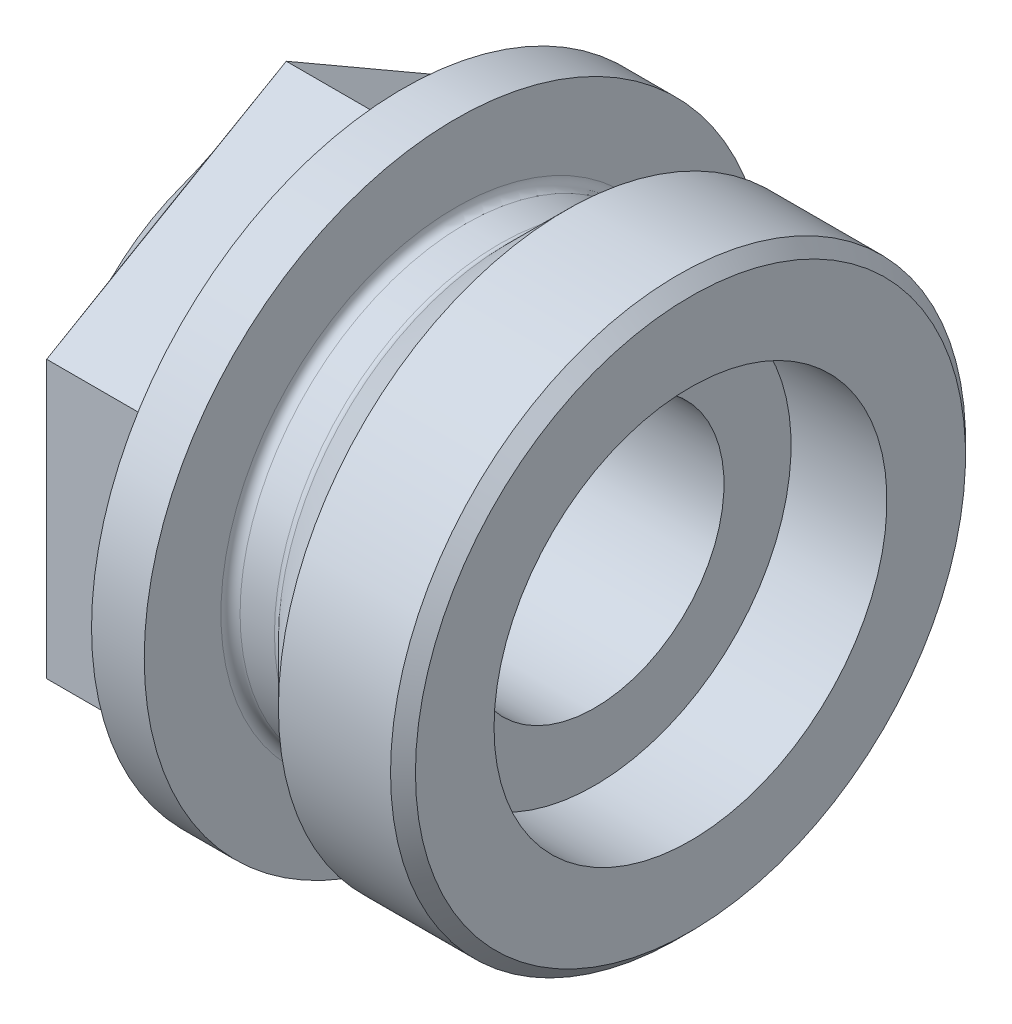
ISO-10303-21;
HEADER;
FILE_DESCRIPTION(('STEP AP214'),'2;1');
FILE_NAME('part.step','',(''),(''),'','','');
FILE_SCHEMA(('AUTOMOTIVE_DESIGN { 1 0 10303 214 1 1 1 1 }'));
ENDSEC;
DATA;
#1=APPLICATION_CONTEXT('core data for automotive mechanical design processes');
#2=APPLICATION_PROTOCOL_DEFINITION('international standard','automotive_design',2000,#1);
#3=PRODUCT_CONTEXT('',#1,'mechanical');
#4=PRODUCT('Part','Part','',(#3));
#5=PRODUCT_RELATED_PRODUCT_CATEGORY('part','',(#4));
#6=PRODUCT_DEFINITION_FORMATION('','',#4);
#7=PRODUCT_DEFINITION_CONTEXT('part definition',#1,'design');
#8=PRODUCT_DEFINITION('design','',#6,#7);
#9=PRODUCT_DEFINITION_SHAPE('','',#8);
#10=(LENGTH_UNIT() NAMED_UNIT(*) SI_UNIT(.MILLI.,.METRE.));
#11=(NAMED_UNIT(*) PLANE_ANGLE_UNIT() SI_UNIT($,.RADIAN.));
#12=(NAMED_UNIT(*) SI_UNIT($,.STERADIAN.) SOLID_ANGLE_UNIT());
#13=UNCERTAINTY_MEASURE_WITH_UNIT(LENGTH_MEASURE(1.E-05),#10,'distance_accuracy_value','');
#14=(GEOMETRIC_REPRESENTATION_CONTEXT(3) GLOBAL_UNCERTAINTY_ASSIGNED_CONTEXT((#13)) GLOBAL_UNIT_ASSIGNED_CONTEXT((#10,
#11,#12)) REPRESENTATION_CONTEXT('',''));
#15=CARTESIAN_POINT('',(0.,0.,0.));
#16=DIRECTION('',(0.,0.,1.));
#17=DIRECTION('',(1.,0.,0.));
#18=AXIS2_PLACEMENT_3D('',#15,#16,#17);
#19=CARTESIAN_POINT('',(0.,0.,0.));
#20=DIRECTION('',(-1.,0.,0.));
#21=DIRECTION('',(0.,0.,1.));
#22=AXIS2_PLACEMENT_3D('',#19,#20,#21);
#23=CYLINDRICAL_SURFACE('',#22,20.5);
#24=CARTESIAN_POINT('',(9.5,0.,0.));
#25=DIRECTION('',(-1.,0.,0.));
#26=DIRECTION('',(0.,0.,1.));
#27=AXIS2_PLACEMENT_3D('',#24,#25,#26);
#28=CIRCLE('',#27,20.5);
#29=CARTESIAN_POINT('',(9.5,0.,20.5));
#30=VERTEX_POINT('',#29);
#31=EDGE_CURVE('E169',#30,#30,#28,.T.);
#32=ORIENTED_EDGE('',*,*,#31,.T.);
#33=EDGE_LOOP('',(#32));
#34=FACE_BOUND('',#33,.T.);
#35=CARTESIAN_POINT('',(19.5,0.,0.));
#36=DIRECTION('',(-1.,0.,0.));
#37=DIRECTION('',(0.,0.,1.));
#38=AXIS2_PLACEMENT_3D('',#35,#36,#37);
#39=CIRCLE('',#38,20.5);
#40=CARTESIAN_POINT('',(19.5,0.,20.5));
#41=VERTEX_POINT('',#40);
#42=EDGE_CURVE('E185',#41,#41,#39,.T.);
#43=ORIENTED_EDGE('',*,*,#42,.F.);
#44=EDGE_LOOP('',(#43));
#45=FACE_BOUND('',#44,.T.);
#46=ADVANCED_FACE('F81',(#34,#45),#23,.F.);
#47=CARTESIAN_POINT('',(19.5,-20.5,0.));
#48=DIRECTION('',(1.,0.,0.));
#49=DIRECTION('',(0.,0.,-1.));
#50=AXIS2_PLACEMENT_3D('',#47,#48,#49);
#51=PLANE('',#50);
#52=CARTESIAN_POINT('',(19.5,0.,0.));
#53=DIRECTION('',(1.,0.,0.));
#54=DIRECTION('',(0.,0.,-1.));
#55=AXIS2_PLACEMENT_3D('',#52,#53,#54);
#56=CIRCLE('',#55,28.7);
#57=CARTESIAN_POINT('',(19.5,0.,28.7));
#58=VERTEX_POINT('',#57);
#59=EDGE_CURVE('E13',#58,#58,#56,.T.);
#60=ORIENTED_EDGE('',*,*,#59,.T.);
#61=EDGE_LOOP('',(#60));
#62=FACE_BOUND('',#61,.T.);
#63=ORIENTED_EDGE('',*,*,#42,.T.);
#64=EDGE_LOOP('',(#63));
#65=FACE_BOUND('',#64,.T.);
#66=ADVANCED_FACE('F241',(#62,#65),#51,.T.);
#67=CARTESIAN_POINT('',(0.,0.,0.));
#68=DIRECTION('',(-1.,0.,0.));
#69=DIRECTION('',(0.,0.,1.));
#70=AXIS2_PLACEMENT_3D('',#67,#68,#69);
#71=CYLINDRICAL_SURFACE('',#70,30.);
#72=CARTESIAN_POINT('',(18.2,0.,0.));
#73=DIRECTION('',(1.,0.,0.));
#74=DIRECTION('',(0.,0.,-1.));
#75=AXIS2_PLACEMENT_3D('',#72,#73,#74);
#76=CIRCLE('',#75,30.);
#77=CARTESIAN_POINT('',(18.2,0.,30.));
#78=VERTEX_POINT('',#77);
#79=EDGE_CURVE('E91',#78,#78,#76,.F.);
#80=ORIENTED_EDGE('',*,*,#79,.T.);
#81=EDGE_LOOP('',(#80));
#82=FACE_BOUND('',#81,.T.);
#83=CARTESIAN_POINT('',(6.49999999999989,0.,0.));
#84=DIRECTION('',(-1.,0.,0.));
#85=DIRECTION('',(0.,0.,1.));
#86=AXIS2_PLACEMENT_3D('',#83,#84,#85);
#87=CIRCLE('',#86,30.);
#88=CARTESIAN_POINT('',(6.49999999999989,0.,30.));
#89=VERTEX_POINT('',#88);
#90=EDGE_CURVE('E182',#89,#89,#87,.T.);
#91=ORIENTED_EDGE('',*,*,#90,.F.);
#92=EDGE_LOOP('',(#91));
#93=FACE_BOUND('',#92,.T.);
#94=ADVANCED_FACE('F228',(#82,#93),#71,.T.);
#95=CARTESIAN_POINT('',(0.,0.,0.));
#96=DIRECTION('',(1.,0.,0.));
#97=DIRECTION('',(0.,0.,-1.));
#98=AXIS2_PLACEMENT_3D('',#95,#96,#97);
#99=CONICAL_SURFACE('',#98,23.5,0.785398163397457);
#100=CARTESIAN_POINT('',(0.292893218813452,0.,0.));
#101=DIRECTION('',(1.,0.,0.));
#102=DIRECTION('',(0.,0.,-1.));
#103=AXIS2_PLACEMENT_3D('',#100,#101,#102);
#104=CIRCLE('',#103,23.7928932188135);
#105=CARTESIAN_POINT('',(0.292893218813452,0.,-23.7928932188135));
#106=VERTEX_POINT('',#105);
#107=EDGE_CURVE('E220',#106,#106,#104,.T.);
#108=ORIENTED_EDGE('',*,*,#107,.T.);
#109=EDGE_LOOP('',(#108));
#110=FACE_BOUND('',#109,.T.);
#111=ORIENTED_EDGE('',*,*,#90,.T.);
#112=EDGE_LOOP('',(#111));
#113=FACE_BOUND('',#112,.T.);
#114=ADVANCED_FACE('F269',(#110,#113),#99,.T.);
#115=CARTESIAN_POINT('',(0.,0.,0.));
#116=DIRECTION('',(-1.,0.,0.));
#117=DIRECTION('',(0.,0.,1.));
#118=AXIS2_PLACEMENT_3D('',#115,#116,#117);
#119=CYLINDRICAL_SURFACE('',#118,23.5);
#120=CARTESIAN_POINT('',(-0.414213562373099,0.,0.));
#121=DIRECTION('',(-1.,0.,0.));
#122=DIRECTION('',(0.,0.,1.));
#123=AXIS2_PLACEMENT_3D('',#120,#121,#122);
#124=CIRCLE('',#123,23.5);
#125=CARTESIAN_POINT('',(-0.414213562373099,0.,23.5));
#126=VERTEX_POINT('',#125);
#127=EDGE_CURVE('E217',#126,#126,#124,.T.);
#128=ORIENTED_EDGE('',*,*,#127,.T.);
#129=EDGE_LOOP('',(#128));
#130=FACE_BOUND('',#129,.T.);
#131=CARTESIAN_POINT('',(-4.,0.,0.));
#132=DIRECTION('',(1.,0.,0.));
#133=DIRECTION('',(0.,0.,-1.));
#134=AXIS2_PLACEMENT_3D('',#131,#132,#133);
#135=CIRCLE('',#134,23.5);
#136=CARTESIAN_POINT('',(-4.,0.,-23.5));
#137=VERTEX_POINT('',#136);
#138=EDGE_CURVE('E188',#137,#137,#135,.T.);
#139=ORIENTED_EDGE('',*,*,#138,.T.);
#140=EDGE_LOOP('',(#139));
#141=FACE_BOUND('',#140,.T.);
#142=ADVANCED_FACE('F265',(#130,#141),#119,.T.);
#143=CARTESIAN_POINT('',(-5.,-23.5,0.));
#144=DIRECTION('',(1.,0.,0.));
#145=DIRECTION('',(0.,0.,-1.));
#146=AXIS2_PLACEMENT_3D('',#143,#144,#145);
#147=PLANE('',#146);
#148=CARTESIAN_POINT('',(-5.,0.,0.));
#149=DIRECTION('',(1.,0.,0.));
#150=DIRECTION('',(0.,0.,-1.));
#151=AXIS2_PLACEMENT_3D('',#148,#149,#150);
#152=CIRCLE('',#151,24.5);
#153=CARTESIAN_POINT('',(-5.,0.,-24.5));
#154=VERTEX_POINT('',#153);
#155=EDGE_CURVE('E223',#154,#154,#152,.F.);
#156=ORIENTED_EDGE('',*,*,#155,.T.);
#157=EDGE_LOOP('',(#156));
#158=FACE_BOUND('',#157,.T.);
#159=CARTESIAN_POINT('',(-5.,0.,0.));
#160=DIRECTION('',(-1.,0.,0.));
#161=DIRECTION('',(0.,0.,1.));
#162=AXIS2_PLACEMENT_3D('',#159,#160,#161);
#163=CIRCLE('',#162,32.5);
#164=CARTESIAN_POINT('',(-5.,0.,32.5));
#165=VERTEX_POINT('',#164);
#166=EDGE_CURVE('E179',#165,#165,#163,.T.);
#167=ORIENTED_EDGE('',*,*,#166,.F.);
#168=EDGE_LOOP('',(#167));
#169=FACE_BOUND('',#168,.T.);
#170=ADVANCED_FACE('F268',(#158,#169),#147,.T.);
#171=CARTESIAN_POINT('',(0.,0.,0.));
#172=DIRECTION('',(-1.,0.,0.));
#173=DIRECTION('',(0.,0.,1.));
#174=AXIS2_PLACEMENT_3D('',#171,#172,#173);
#175=CYLINDRICAL_SURFACE('',#174,32.5);
#176=ORIENTED_EDGE('',*,*,#166,.T.);
#177=EDGE_LOOP('',(#176));
#178=FACE_BOUND('',#177,.T.);
#179=CARTESIAN_POINT('',(-10.5,0.,0.));
#180=DIRECTION('',(-1.,0.,0.));
#181=DIRECTION('',(0.,0.,1.));
#182=AXIS2_PLACEMENT_3D('',#179,#180,#181);
#183=CIRCLE('',#182,32.5);
#184=CARTESIAN_POINT('',(-10.5,0.,32.5));
#185=VERTEX_POINT('',#184);
#186=EDGE_CURVE('E176',#185,#185,#183,.T.);
#187=ORIENTED_EDGE('',*,*,#186,.F.);
#188=EDGE_LOOP('',(#187));
#189=FACE_BOUND('',#188,.T.);
#190=ADVANCED_FACE('F277',(#178,#189),#175,.T.);
#191=CARTESIAN_POINT('',(-10.5,-32.5,0.));
#192=DIRECTION('',(-1.,0.,0.));
#193=DIRECTION('',(0.,0.,1.));
#194=AXIS2_PLACEMENT_3D('',#191,#192,#193);
#195=PLANE('',#194);
#196=DIRECTION('',(0.,1.,0.));
#197=VECTOR('',#196,1.);
#198=CARTESIAN_POINT('',(-10.5,-14.4337567297407,25.));
#199=LINE('',#198,#197);
#200=CARTESIAN_POINT('',(-10.5,-14.4337567297407,25.));
#201=VERTEX_POINT('',#200);
#202=CARTESIAN_POINT('',(-10.5,14.4337567297407,25.));
#203=VERTEX_POINT('',#202);
#204=EDGE_CURVE('E99',#201,#203,#199,.T.);
#205=ORIENTED_EDGE('',*,*,#204,.F.);
#206=DIRECTION('',(0.,0.5,0.866025403784439));
#207=VECTOR('',#206,1.);
#208=CARTESIAN_POINT('',(-10.5,-28.8675134594813,0.));
#209=LINE('',#208,#207);
#210=CARTESIAN_POINT('',(-10.5,-28.8675134594813,0.));
#211=VERTEX_POINT('',#210);
#212=EDGE_CURVE('E153',#211,#201,#209,.T.);
#213=ORIENTED_EDGE('',*,*,#212,.F.);
#214=DIRECTION('',(0.,-0.5,0.866025403784439));
#215=VECTOR('',#214,1.);
#216=CARTESIAN_POINT('',(-10.5,-14.4337567297406,-25.));
#217=LINE('',#216,#215);
#218=CARTESIAN_POINT('',(-10.5,-14.4337567297406,-25.));
#219=VERTEX_POINT('',#218);
#220=EDGE_CURVE('E147',#219,#211,#217,.T.);
#221=ORIENTED_EDGE('',*,*,#220,.F.);
#222=DIRECTION('',(0.,-1.,0.));
#223=VECTOR('',#222,1.);
#224=CARTESIAN_POINT('',(-10.5,14.4337567297407,-25.));
#225=LINE('',#224,#223);
#226=CARTESIAN_POINT('',(-10.5,14.4337567297407,-25.));
#227=VERTEX_POINT('',#226);
#228=EDGE_CURVE('E151',#227,#219,#225,.T.);
#229=ORIENTED_EDGE('',*,*,#228,.F.);
#230=DIRECTION('',(0.,-0.5,-0.866025403784439));
#231=VECTOR('',#230,1.);
#232=CARTESIAN_POINT('',(-10.5,28.8675134594813,0.));
#233=LINE('',#232,#231);
#234=CARTESIAN_POINT('',(-10.5,28.8675134594813,0.));
#235=VERTEX_POINT('',#234);
#236=EDGE_CURVE('E138',#235,#227,#233,.T.);
#237=ORIENTED_EDGE('',*,*,#236,.F.);
#238=DIRECTION('',(0.,0.5,-0.866025403784439));
#239=VECTOR('',#238,1.);
#240=CARTESIAN_POINT('',(-10.5,14.4337567297407,25.));
#241=LINE('',#240,#239);
#242=EDGE_CURVE('E163',#203,#235,#241,.T.);
#243=ORIENTED_EDGE('',*,*,#242,.F.);
#244=EDGE_LOOP('',(#205,#213,#221,#229,#237,#243));
#245=FACE_BOUND('',#244,.T.);
#246=ORIENTED_EDGE('',*,*,#186,.T.);
#247=EDGE_LOOP('',(#246));
#248=FACE_BOUND('',#247,.T.);
#249=ADVANCED_FACE('F148',(#245,#248),#195,.T.);
#250=CARTESIAN_POINT('',(0.,0.,0.));
#251=DIRECTION('',(-1.,0.,0.));
#252=DIRECTION('',(0.,0.,1.));
#253=AXIS2_PLACEMENT_3D('',#250,#251,#252);
#254=CYLINDRICAL_SURFACE('',#253,13.5);
#255=CARTESIAN_POINT('',(9.5,0.,0.));
#256=DIRECTION('',(-1.,0.,0.));
#257=DIRECTION('',(0.,0.,1.));
#258=AXIS2_PLACEMENT_3D('',#255,#256,#257);
#259=CIRCLE('',#258,13.5);
#260=CARTESIAN_POINT('',(9.5,0.,13.5));
#261=VERTEX_POINT('',#260);
#262=EDGE_CURVE('E172',#261,#261,#259,.T.);
#263=ORIENTED_EDGE('',*,*,#262,.F.);
#264=EDGE_LOOP('',(#263));
#265=FACE_BOUND('',#264,.T.);
#266=CARTESIAN_POINT('',(-26.5,0.,0.));
#267=DIRECTION('',(-1.,0.,0.));
#268=DIRECTION('',(0.,0.,1.));
#269=AXIS2_PLACEMENT_3D('',#266,#267,#268);
#270=CIRCLE('',#269,13.5);
#271=CARTESIAN_POINT('',(-26.5,0.,13.5));
#272=VERTEX_POINT('',#271);
#273=EDGE_CURVE('E211',#272,#272,#270,.T.);
#274=ORIENTED_EDGE('',*,*,#273,.T.);
#275=EDGE_LOOP('',(#274));
#276=FACE_BOUND('',#275,.T.);
#277=ADVANCED_FACE('F286',(#265,#276),#254,.F.);
#278=CARTESIAN_POINT('',(9.5,-20.5,0.));
#279=DIRECTION('',(1.,0.,0.));
#280=DIRECTION('',(0.,0.,-1.));
#281=AXIS2_PLACEMENT_3D('',#278,#279,#280);
#282=PLANE('',#281);
#283=ORIENTED_EDGE('',*,*,#262,.T.);
#284=EDGE_LOOP('',(#283));
#285=FACE_BOUND('',#284,.T.);
#286=ORIENTED_EDGE('',*,*,#31,.F.);
#287=EDGE_LOOP('',(#286));
#288=FACE_BOUND('',#287,.T.);
#289=ADVANCED_FACE('F291',(#285,#288),#282,.T.);
#290=CARTESIAN_POINT('',(-102.876261582597,-28.8675134594813,0.));
#291=DIRECTION('',(0.,0.866025403784439,-0.5));
#292=DIRECTION('',(0.,0.5,0.866025403784439));
#293=AXIS2_PLACEMENT_3D('',#290,#291,#292);
#294=PLANE('',#293);
#295=DIRECTION('',(0.,0.5,0.866025403784439));
#296=VECTOR('',#295,1.);
#297=CARTESIAN_POINT('',(-22.68,-28.8675134594813,0.));
#298=LINE('',#297,#296);
#299=CARTESIAN_POINT('',(-22.68,-28.8675134594813,0.));
#300=VERTEX_POINT('',#299);
#301=CARTESIAN_POINT('',(-22.68,-14.4337567297407,25.));
#302=VERTEX_POINT('',#301);
#303=EDGE_CURVE('E205',#300,#302,#298,.T.);
#304=ORIENTED_EDGE('',*,*,#303,.F.);
#305=DIRECTION('',(1.,0.,0.));
#306=VECTOR('',#305,1.);
#307=CARTESIAN_POINT('',(-102.876261582597,-28.8675134594813,0.));
#308=LINE('',#307,#306);
#309=EDGE_CURVE('E159',#300,#211,#308,.T.);
#310=ORIENTED_EDGE('',*,*,#309,.T.);
#311=ORIENTED_EDGE('',*,*,#212,.T.);
#312=DIRECTION('',(1.,0.,0.));
#313=VECTOR('',#312,1.);
#314=CARTESIAN_POINT('',(-102.876261582597,-14.4337567297407,25.));
#315=LINE('',#314,#313);
#316=EDGE_CURVE('E168',#302,#201,#315,.T.);
#317=ORIENTED_EDGE('',*,*,#316,.F.);
#318=EDGE_LOOP('',(#304,#310,#311,#317));
#319=FACE_BOUND('',#318,.T.);
#320=ADVANCED_FACE('F331',(#319),#294,.F.);
#321=CARTESIAN_POINT('',(-102.876261582597,-14.4337567297406,-25.));
#322=DIRECTION('',(0.,0.866025403784438,0.5));
#323=DIRECTION('',(0.,-0.5,0.866025403784439));
#324=AXIS2_PLACEMENT_3D('',#321,#322,#323);
#325=PLANE('',#324);
#326=DIRECTION('',(0.,-0.5,0.866025403784439));
#327=VECTOR('',#326,1.);
#328=CARTESIAN_POINT('',(-22.68,-14.4337567297406,-25.));
#329=LINE('',#328,#327);
#330=CARTESIAN_POINT('',(-22.68,-14.4337567297406,-25.));
#331=VERTEX_POINT('',#330);
#332=EDGE_CURVE('E133',#331,#300,#329,.T.);
#333=ORIENTED_EDGE('',*,*,#332,.F.);
#334=DIRECTION('',(1.,0.,0.));
#335=VECTOR('',#334,1.);
#336=CARTESIAN_POINT('',(-102.876261582597,-14.4337567297406,-25.));
#337=LINE('',#336,#335);
#338=EDGE_CURVE('E156',#331,#219,#337,.T.);
#339=ORIENTED_EDGE('',*,*,#338,.T.);
#340=ORIENTED_EDGE('',*,*,#220,.T.);
#341=ORIENTED_EDGE('',*,*,#309,.F.);
#342=EDGE_LOOP('',(#333,#339,#340,#341));
#343=FACE_BOUND('',#342,.T.);
#344=ADVANCED_FACE('F157',(#343),#325,.F.);
#345=CARTESIAN_POINT('',(-102.876261582597,14.4337567297407,-25.));
#346=DIRECTION('',(0.,0.,1.));
#347=DIRECTION('',(0.,-1.,0.));
#348=AXIS2_PLACEMENT_3D('',#345,#346,#347);
#349=PLANE('',#348);
#350=DIRECTION('',(0.,-1.,0.));
#351=VECTOR('',#350,1.);
#352=CARTESIAN_POINT('',(-22.68,14.4337567297407,-25.));
#353=LINE('',#352,#351);
#354=CARTESIAN_POINT('',(-22.68,14.4337567297407,-25.));
#355=VERTEX_POINT('',#354);
#356=EDGE_CURVE('E126',#355,#331,#353,.T.);
#357=ORIENTED_EDGE('',*,*,#356,.F.);
#358=DIRECTION('',(1.,0.,0.));
#359=VECTOR('',#358,1.);
#360=CARTESIAN_POINT('',(-102.876261582597,14.4337567297407,-25.));
#361=LINE('',#360,#359);
#362=EDGE_CURVE('E158',#355,#227,#361,.T.);
#363=ORIENTED_EDGE('',*,*,#362,.T.);
#364=ORIENTED_EDGE('',*,*,#228,.T.);
#365=ORIENTED_EDGE('',*,*,#338,.F.);
#366=EDGE_LOOP('',(#357,#363,#364,#365));
#367=FACE_BOUND('',#366,.T.);
#368=ADVANCED_FACE('F161',(#367),#349,.F.);
#369=CARTESIAN_POINT('',(-102.876261582597,28.8675134594813,0.));
#370=DIRECTION('',(0.,-0.866025403784439,0.5));
#371=DIRECTION('',(0.,-0.5,-0.866025403784439));
#372=AXIS2_PLACEMENT_3D('',#369,#370,#371);
#373=PLANE('',#372);
#374=DIRECTION('',(0.,-0.5,-0.866025403784439));
#375=VECTOR('',#374,1.);
#376=CARTESIAN_POINT('',(-22.68,28.8675134594813,0.));
#377=LINE('',#376,#375);
#378=CARTESIAN_POINT('',(-22.68,28.8675134594813,0.));
#379=VERTEX_POINT('',#378);
#380=EDGE_CURVE('E196',#379,#355,#377,.T.);
#381=ORIENTED_EDGE('',*,*,#380,.F.);
#382=DIRECTION('',(1.,0.,0.));
#383=VECTOR('',#382,1.);
#384=CARTESIAN_POINT('',(-102.876261582597,28.8675134594813,0.));
#385=LINE('',#384,#383);
#386=EDGE_CURVE('E191',#379,#235,#385,.T.);
#387=ORIENTED_EDGE('',*,*,#386,.T.);
#388=ORIENTED_EDGE('',*,*,#236,.T.);
#389=ORIENTED_EDGE('',*,*,#362,.F.);
#390=EDGE_LOOP('',(#381,#387,#388,#389));
#391=FACE_BOUND('',#390,.T.);
#392=ADVANCED_FACE('F363',(#391),#373,.F.);
#393=CARTESIAN_POINT('',(-102.876261582597,14.4337567297407,25.));
#394=DIRECTION('',(0.,-0.866025403784439,-0.5));
#395=DIRECTION('',(0.,0.5,-0.866025403784439));
#396=AXIS2_PLACEMENT_3D('',#393,#394,#395);
#397=PLANE('',#396);
#398=DIRECTION('',(0.,0.5,-0.866025403784439));
#399=VECTOR('',#398,1.);
#400=CARTESIAN_POINT('',(-22.68,14.4337567297407,25.));
#401=LINE('',#400,#399);
#402=CARTESIAN_POINT('',(-22.68,14.4337567297407,25.));
#403=VERTEX_POINT('',#402);
#404=EDGE_CURVE('E199',#403,#379,#401,.T.);
#405=ORIENTED_EDGE('',*,*,#404,.F.);
#406=DIRECTION('',(1.,0.,0.));
#407=VECTOR('',#406,1.);
#408=CARTESIAN_POINT('',(-102.876261582597,14.4337567297407,25.));
#409=LINE('',#408,#407);
#410=EDGE_CURVE('E173',#403,#203,#409,.T.);
#411=ORIENTED_EDGE('',*,*,#410,.T.);
#412=ORIENTED_EDGE('',*,*,#242,.T.);
#413=ORIENTED_EDGE('',*,*,#386,.F.);
#414=EDGE_LOOP('',(#405,#411,#412,#413));
#415=FACE_BOUND('',#414,.T.);
#416=ADVANCED_FACE('F372',(#415),#397,.F.);
#417=CARTESIAN_POINT('',(-102.876261582597,-14.4337567297407,25.));
#418=DIRECTION('',(0.,0.,-1.));
#419=DIRECTION('',(0.,1.,0.));
#420=AXIS2_PLACEMENT_3D('',#417,#418,#419);
#421=PLANE('',#420);
#422=DIRECTION('',(0.,1.,0.));
#423=VECTOR('',#422,1.);
#424=CARTESIAN_POINT('',(-22.68,-14.4337567297407,25.));
#425=LINE('',#424,#423);
#426=EDGE_CURVE('E202',#302,#403,#425,.T.);
#427=ORIENTED_EDGE('',*,*,#426,.F.);
#428=ORIENTED_EDGE('',*,*,#316,.T.);
#429=ORIENTED_EDGE('',*,*,#204,.T.);
#430=ORIENTED_EDGE('',*,*,#410,.F.);
#431=EDGE_LOOP('',(#427,#428,#429,#430));
#432=FACE_BOUND('',#431,.T.);
#433=ADVANCED_FACE('F382',(#432),#421,.F.);
#434=CARTESIAN_POINT('',(-26.5,0.,0.));
#435=DIRECTION('',(-1.,0.,0.));
#436=DIRECTION('',(0.,0.,1.));
#437=AXIS2_PLACEMENT_3D('',#434,#435,#436);
#438=PLANE('',#437);
#439=ORIENTED_EDGE('',*,*,#273,.F.);
#440=EDGE_LOOP('',(#439));
#441=FACE_BOUND('',#440,.T.);
#442=CARTESIAN_POINT('',(-26.5,0.,0.));
#443=DIRECTION('',(-1.,0.,0.));
#444=DIRECTION('',(0.,0.,1.));
#445=AXIS2_PLACEMENT_3D('',#442,#443,#444);
#446=CIRCLE('',#445,20.5);
#447=CARTESIAN_POINT('',(-26.5,10.25,-17.753520777581));
#448=VERTEX_POINT('',#447);
#449=CARTESIAN_POINT('',(-26.5,-10.25,-17.753520777581));
#450=VERTEX_POINT('',#449);
#451=EDGE_CURVE('E208',#448,#450,#446,.T.);
#452=ORIENTED_EDGE('',*,*,#451,.T.);
#453=CARTESIAN_POINT('',(-26.5,-20.5,0.));
#454=VERTEX_POINT('',#453);
#455=EDGE_CURVE('E527',#450,#454,#446,.T.);
#456=ORIENTED_EDGE('',*,*,#455,.T.);
#457=CARTESIAN_POINT('',(-26.5,-10.25,17.753520777581));
#458=VERTEX_POINT('',#457);
#459=EDGE_CURVE('E528',#454,#458,#446,.T.);
#460=ORIENTED_EDGE('',*,*,#459,.T.);
#461=CARTESIAN_POINT('',(-26.5,10.25,17.753520777581));
#462=VERTEX_POINT('',#461);
#463=EDGE_CURVE('E513',#458,#462,#446,.T.);
#464=ORIENTED_EDGE('',*,*,#463,.T.);
#465=CARTESIAN_POINT('',(-26.5,20.5,0.));
#466=VERTEX_POINT('',#465);
#467=EDGE_CURVE('E505',#462,#466,#446,.T.);
#468=ORIENTED_EDGE('',*,*,#467,.T.);
#469=EDGE_CURVE('E514',#466,#448,#446,.T.);
#470=ORIENTED_EDGE('',*,*,#469,.T.);
#471=EDGE_LOOP('',(#452,#456,#460,#464,#468,#470));
#472=FACE_BOUND('',#471,.T.);
#473=ADVANCED_FACE('F392',(#441,#472),#438,.T.);
#474=CARTESIAN_POINT('',(-22.68,-14.4337567297406,-25.));
#475=CARTESIAN_POINT('',(-26.5,-10.25,-17.753520777581));
#476=CARTESIAN_POINT('',(-22.68,-15.6365697905524,-22.9166666666667));
#477=CARTESIAN_POINT('',(-26.5,-11.7294600647984,-16.8993541109143));
#478=CARTESIAN_POINT('',(-22.68,-16.8393828513641,-20.8333333333333));
#479=CARTESIAN_POINT('',(-26.5,-13.1517196023302,-15.8277476761212));
#480=CARTESIAN_POINT('',(-22.68,-19.2450089729875,-16.6666666666667));
#481=CARTESIAN_POINT('',(-26.5,-15.7070491920448,-13.2956357755454));
#482=CARTESIAN_POINT('',(-22.68,-20.4478220337992,-14.5833333333333));
#483=CARTESIAN_POINT('',(-26.5,-16.8380277034413,-11.8356805183873));
#484=CARTESIAN_POINT('',(-22.68,-22.8534481554227,-10.4166666666667));
#485=CARTESIAN_POINT('',(-26.5,-18.6690138517207,-8.66431948161268));
#486=CARTESIAN_POINT('',(-22.68,-24.0562612162344,-8.33333333333332));
#487=CARTESIAN_POINT('',(-26.5,-19.3678829371099,-6.95488573102994));
#488=CARTESIAN_POINT('',(-22.68,-26.4618873378579,-4.16666666666665));
#489=CARTESIAN_POINT('',(-26.5,-20.2830913733762,-3.47584944100711));
#490=CARTESIAN_POINT('',(-22.68,-27.6647003986696,-2.08333333333332));
#491=CARTESIAN_POINT('',(-26.5,-20.5,-1.70833333333334));
#492=CARTESIAN_POINT('',(-22.68,-28.8675134594813,0.));
#493=CARTESIAN_POINT('',(-26.5,-20.5,0.));
#494=B_SPLINE_SURFACE_WITH_KNOTS('',3,1,((#474,#475),(#476,#477),(#478,#479),(#480,#481),(#482,
#483),(#484,#485),(#486,#487),(#488,#489),(#490,#491),(#492,#493)),.UNSPECIFIED.,.F.,.F.,.F.,(4,
2,2,2,4),(2,2),(0.,0.25,0.5,0.75,1.),(0.,1.),.UNSPECIFIED.);
#495=DIRECTION('',(-0.415296686257483,0.9096860240674,0.));
#496=VECTOR('',#495,1.);
#497=CARTESIAN_POINT('',(-24.59,-24.6837567297407,0.));
#498=LINE('',#497,#496);
#499=EDGE_CURVE('E549',#300,#454,#498,.T.);
#500=DIRECTION('',(0.415296686257483,-0.4548430120337,-0.78781120631003));
#501=VECTOR('',#500,1.);
#502=CARTESIAN_POINT('',(-24.59,-12.3418783648703,-21.3767603887905));
#503=LINE('',#502,#501);
#504=EDGE_CURVE('E214',#450,#331,#503,.T.);
#505=ORIENTED_EDGE('',*,*,#332,.T.);
#506=ORIENTED_EDGE('',*,*,#499,.T.);
#507=ORIENTED_EDGE('',*,*,#455,.F.);
#508=ORIENTED_EDGE('',*,*,#504,.T.);
#509=EDGE_LOOP('',(#505,#506,#507,#508));
#510=FACE_BOUND('',#509,.T.);
#511=ADVANCED_FACE('F400',(#510),#494,.T.);
#512=CARTESIAN_POINT('',(-22.68,-28.8675134594813,0.));
#513=CARTESIAN_POINT('',(-26.5,-20.5,0.));
#514=CARTESIAN_POINT('',(-22.68,-27.6647003986696,2.08333333333335));
#515=CARTESIAN_POINT('',(-26.5,-20.5,1.70833333333333));
#516=CARTESIAN_POINT('',(-22.68,-26.4618873378579,4.16666666666668));
#517=CARTESIAN_POINT('',(-26.5,-20.2830913733762,3.4758494410071));
#518=CARTESIAN_POINT('',(-22.68,-24.0562612162344,8.33333333333335));
#519=CARTESIAN_POINT('',(-26.5,-19.3678829371099,6.95488573102993));
#520=CARTESIAN_POINT('',(-22.68,-22.8534481554227,10.4166666666667));
#521=CARTESIAN_POINT('',(-26.5,-18.6690138517207,8.66431948161266));
#522=CARTESIAN_POINT('',(-22.68,-20.4478220337993,14.5833333333334));
#523=CARTESIAN_POINT('',(-26.5,-16.8380277034413,11.8356805183873));
#524=CARTESIAN_POINT('',(-22.68,-19.2450089729875,16.6666666666667));
#525=CARTESIAN_POINT('',(-26.5,-15.7070491920448,13.2956357755454));
#526=CARTESIAN_POINT('',(-22.68,-16.8393828513641,20.8333333333333));
#527=CARTESIAN_POINT('',(-26.5,-13.1517196023302,15.8277476761212));
#528=CARTESIAN_POINT('',(-22.68,-15.6365697905524,22.9166666666667));
#529=CARTESIAN_POINT('',(-26.5,-11.7294600647984,16.8993541109143));
#530=CARTESIAN_POINT('',(-22.68,-14.4337567297407,25.));
#531=CARTESIAN_POINT('',(-26.5,-10.25,17.753520777581));
#532=B_SPLINE_SURFACE_WITH_KNOTS('',3,1,((#512,#513),(#514,#515),(#516,#517),(#518,#519),(#520,
#521),(#522,#523),(#524,#525),(#526,#527),(#528,#529),(#530,#531)),.UNSPECIFIED.,.F.,.F.,.F.,(4,
2,2,2,4),(2,2),(0.,0.25,0.5,0.75,1.),(0.,1.),.UNSPECIFIED.);
#533=DIRECTION('',(-0.415296686257482,0.454843012033698,-0.787811206310032));
#534=VECTOR('',#533,1.);
#535=CARTESIAN_POINT('',(-24.59,-12.3418783648703,21.3767603887905));
#536=LINE('',#535,#534);
#537=EDGE_CURVE('E553',#302,#458,#536,.T.);
#538=ORIENTED_EDGE('',*,*,#303,.T.);
#539=ORIENTED_EDGE('',*,*,#537,.T.);
#540=ORIENTED_EDGE('',*,*,#459,.F.);
#541=ORIENTED_EDGE('',*,*,#499,.F.);
#542=EDGE_LOOP('',(#538,#539,#540,#541));
#543=FACE_BOUND('',#542,.T.);
#544=ADVANCED_FACE('F405',(#543),#532,.T.);
#545=CARTESIAN_POINT('',(-22.68,14.4337567297407,-25.));
#546=CARTESIAN_POINT('',(-26.5,10.25,-17.753520777581));
#547=CARTESIAN_POINT('',(-22.68,12.0281306081172,-25.));
#548=CARTESIAN_POINT('',(-26.5,8.77053993520159,-18.6076874442477));
#549=CARTESIAN_POINT('',(-22.68,9.6225044864938,-25.));
#550=CARTESIAN_POINT('',(-26.5,7.13137177104601,-19.3035971171283));
#551=CARTESIAN_POINT('',(-22.68,4.81125224324693,-25.));
#552=CARTESIAN_POINT('',(-26.5,3.66083374506513,-20.2505215065753));
#553=CARTESIAN_POINT('',(-22.68,2.40562612162349,-25.));
#554=CARTESIAN_POINT('',(-26.5,1.83098614827935,-20.5));
#555=CARTESIAN_POINT('',(-22.68,-2.40562612162339,-25.));
#556=CARTESIAN_POINT('',(-26.5,-1.83098614827933,-20.5));
#557=CARTESIAN_POINT('',(-22.68,-4.81125224324684,-25.));
#558=CARTESIAN_POINT('',(-26.5,-3.66083374506512,-20.2505215065753));
#559=CARTESIAN_POINT('',(-22.68,-9.62250448649374,-25.));
#560=CARTESIAN_POINT('',(-26.5,-7.131371771046,-19.3035971171283));
#561=CARTESIAN_POINT('',(-22.68,-12.0281306081172,-25.));
#562=CARTESIAN_POINT('',(-26.5,-8.77053993520158,-18.6076874442477));
#563=CARTESIAN_POINT('',(-22.68,-14.4337567297406,-25.));
#564=CARTESIAN_POINT('',(-26.5,-10.25,-17.753520777581));
#565=B_SPLINE_SURFACE_WITH_KNOTS('',3,1,((#545,#546),(#547,#548),(#549,#550),(#551,#552),(#553,
#554),(#555,#556),(#557,#558),(#559,#560),(#561,#562),(#563,#564)),.UNSPECIFIED.,.F.,.F.,.F.,(4,
2,2,2,4),(2,2),(0.,0.25,0.5,0.75,1.),(0.,1.),.UNSPECIFIED.);
#566=DIRECTION('',(-0.415296686257483,-0.4548430120337,0.78781120631003));
#567=VECTOR('',#566,1.);
#568=CARTESIAN_POINT('',(-24.59,12.3418783648703,-21.3767603887905));
#569=LINE('',#568,#567);
#570=EDGE_CURVE('E623',#355,#448,#569,.T.);
#571=ORIENTED_EDGE('',*,*,#356,.T.);
#572=ORIENTED_EDGE('',*,*,#504,.F.);
#573=ORIENTED_EDGE('',*,*,#451,.F.);
#574=ORIENTED_EDGE('',*,*,#570,.F.);
#575=EDGE_LOOP('',(#571,#572,#573,#574));
#576=FACE_BOUND('',#575,.T.);
#577=ADVANCED_FACE('F415',(#576),#565,.T.);
#578=CARTESIAN_POINT('',(-22.68,-14.4337567297407,25.));
#579=CARTESIAN_POINT('',(-26.5,-10.25,17.753520777581));
#580=CARTESIAN_POINT('',(-22.68,-12.0281306081172,25.));
#581=CARTESIAN_POINT('',(-26.5,-8.77053993520161,18.6076874442476));
#582=CARTESIAN_POINT('',(-22.68,-9.62250448649377,25.));
#583=CARTESIAN_POINT('',(-26.5,-7.13137177104603,19.3035971171283));
#584=CARTESIAN_POINT('',(-22.68,-4.81125224324687,25.));
#585=CARTESIAN_POINT('',(-26.5,-3.66083374506514,20.2505215065753));
#586=CARTESIAN_POINT('',(-22.68,-2.40562612162343,25.));
#587=CARTESIAN_POINT('',(-26.5,-1.83098614827935,20.5));
#588=CARTESIAN_POINT('',(-22.68,2.40562612162346,25.));
#589=CARTESIAN_POINT('',(-26.5,1.83098614827933,20.5));
#590=CARTESIAN_POINT('',(-22.68,4.8112522432469,25.));
#591=CARTESIAN_POINT('',(-26.5,3.66083374506512,20.2505215065753));
#592=CARTESIAN_POINT('',(-22.68,9.62250448649378,25.));
#593=CARTESIAN_POINT('',(-26.5,7.13137177104601,19.3035971171283));
#594=CARTESIAN_POINT('',(-22.68,12.0281306081172,25.));
#595=CARTESIAN_POINT('',(-26.5,8.77053993520159,18.6076874442477));
#596=CARTESIAN_POINT('',(-22.68,14.4337567297407,25.));
#597=CARTESIAN_POINT('',(-26.5,10.25,17.753520777581));
#598=B_SPLINE_SURFACE_WITH_KNOTS('',3,1,((#578,#579),(#580,#581),(#582,#583),(#584,#585),(#586,
#587),(#588,#589),(#590,#591),(#592,#593),(#594,#595),(#596,#597)),.UNSPECIFIED.,.F.,.F.,.F.,(4,
2,2,2,4),(2,2),(0.,0.25,0.5,0.75,1.),(0.,1.),.UNSPECIFIED.);
#599=DIRECTION('',(-0.415296686257483,-0.4548430120337,-0.78781120631003));
#600=VECTOR('',#599,1.);
#601=CARTESIAN_POINT('',(-24.59,12.3418783648703,21.3767603887905));
#602=LINE('',#601,#600);
#603=EDGE_CURVE('E565',#403,#462,#602,.T.);
#604=ORIENTED_EDGE('',*,*,#426,.T.);
#605=ORIENTED_EDGE('',*,*,#603,.T.);
#606=ORIENTED_EDGE('',*,*,#463,.F.);
#607=ORIENTED_EDGE('',*,*,#537,.F.);
#608=EDGE_LOOP('',(#604,#605,#606,#607));
#609=FACE_BOUND('',#608,.T.);
#610=ADVANCED_FACE('F425',(#609),#598,.T.);
#611=CARTESIAN_POINT('',(-22.68,14.4337567297407,25.));
#612=CARTESIAN_POINT('',(-26.5,10.25,17.753520777581));
#613=CARTESIAN_POINT('',(-22.68,15.6365697905524,22.9166666666667));
#614=CARTESIAN_POINT('',(-26.5,11.7294600647984,16.8993541109143));
#615=CARTESIAN_POINT('',(-22.68,16.8393828513641,20.8333333333333));
#616=CARTESIAN_POINT('',(-26.5,13.1517196023302,15.8277476761212));
#617=CARTESIAN_POINT('',(-22.68,19.2450089729875,16.6666666666667));
#618=CARTESIAN_POINT('',(-26.5,15.7070491920448,13.2956357755454));
#619=CARTESIAN_POINT('',(-22.68,20.4478220337993,14.5833333333333));
#620=CARTESIAN_POINT('',(-26.5,16.8380277034413,11.8356805183873));
#621=CARTESIAN_POINT('',(-22.68,22.8534481554227,10.4166666666667));
#622=CARTESIAN_POINT('',(-26.5,18.6690138517207,8.66431948161267));
#623=CARTESIAN_POINT('',(-22.68,24.0562612162344,8.33333333333333));
#624=CARTESIAN_POINT('',(-26.5,19.3678829371099,6.95488573102994));
#625=CARTESIAN_POINT('',(-22.68,26.4618873378579,4.16666666666666));
#626=CARTESIAN_POINT('',(-26.5,20.2830913733762,3.4758494410071));
#627=CARTESIAN_POINT('',(-22.68,27.6647003986696,2.08333333333334));
#628=CARTESIAN_POINT('',(-26.5,20.5,1.70833333333334));
#629=CARTESIAN_POINT('',(-22.68,28.8675134594813,0.));
#630=CARTESIAN_POINT('',(-26.5,20.5,0.));
#631=B_SPLINE_SURFACE_WITH_KNOTS('',3,1,((#611,#612),(#613,#614),(#615,#616),(#617,#618),(#619,
#620),(#621,#622),(#623,#624),(#625,#626),(#627,#628),(#629,#630)),.UNSPECIFIED.,.F.,.F.,.F.,(4,
2,2,2,4),(2,2),(0.,0.25,0.5,0.75,1.),(0.,1.),.UNSPECIFIED.);
#632=DIRECTION('',(-0.415296686257483,-0.9096860240674,0.));
#633=VECTOR('',#632,1.);
#634=CARTESIAN_POINT('',(-24.59,24.6837567297406,0.));
#635=LINE('',#634,#633);
#636=EDGE_CURVE('E624',#379,#466,#635,.T.);
#637=ORIENTED_EDGE('',*,*,#404,.T.);
#638=ORIENTED_EDGE('',*,*,#636,.T.);
#639=ORIENTED_EDGE('',*,*,#467,.F.);
#640=ORIENTED_EDGE('',*,*,#603,.F.);
#641=EDGE_LOOP('',(#637,#638,#639,#640));
#642=FACE_BOUND('',#641,.T.);
#643=ADVANCED_FACE('F258',(#642),#631,.T.);
#644=CARTESIAN_POINT('',(-22.68,28.8675134594813,0.));
#645=CARTESIAN_POINT('',(-26.5,20.5,0.));
#646=CARTESIAN_POINT('',(-22.68,27.6647003986696,-2.08333333333334));
#647=CARTESIAN_POINT('',(-26.5,20.5,-1.70833333333333));
#648=CARTESIAN_POINT('',(-22.68,26.4618873378578,-4.16666666666668));
#649=CARTESIAN_POINT('',(-26.5,20.2830913733762,-3.4758494410071));
#650=CARTESIAN_POINT('',(-22.68,24.0562612162344,-8.33333333333335));
#651=CARTESIAN_POINT('',(-26.5,19.3678829371099,-6.95488573102994));
#652=CARTESIAN_POINT('',(-22.68,22.8534481554227,-10.4166666666667));
#653=CARTESIAN_POINT('',(-26.5,18.6690138517207,-8.66431948161267));
#654=CARTESIAN_POINT('',(-22.68,20.4478220337992,-14.5833333333334));
#655=CARTESIAN_POINT('',(-26.5,16.8380277034413,-11.8356805183873));
#656=CARTESIAN_POINT('',(-22.68,19.2450089729875,-16.6666666666667));
#657=CARTESIAN_POINT('',(-26.5,15.7070491920448,-13.2956357755454));
#658=CARTESIAN_POINT('',(-22.68,16.8393828513641,-20.8333333333333));
#659=CARTESIAN_POINT('',(-26.5,13.1517196023302,-15.8277476761212));
#660=CARTESIAN_POINT('',(-22.68,15.6365697905524,-22.9166666666667));
#661=CARTESIAN_POINT('',(-26.5,11.7294600647984,-16.8993541109143));
#662=CARTESIAN_POINT('',(-22.68,14.4337567297407,-25.));
#663=CARTESIAN_POINT('',(-26.5,10.25,-17.753520777581));
#664=B_SPLINE_SURFACE_WITH_KNOTS('',3,1,((#644,#645),(#646,#647),(#648,#649),(#650,#651),(#652,
#653),(#654,#655),(#656,#657),(#658,#659),(#660,#661),(#662,#663)),.UNSPECIFIED.,.F.,.F.,.F.,(4,
2,2,2,4),(2,2),(0.,0.25,0.5,0.75,1.),(0.,1.),.UNSPECIFIED.);
#665=ORIENTED_EDGE('',*,*,#380,.T.);
#666=ORIENTED_EDGE('',*,*,#570,.T.);
#667=ORIENTED_EDGE('',*,*,#469,.F.);
#668=ORIENTED_EDGE('',*,*,#636,.F.);
#669=EDGE_LOOP('',(#665,#666,#667,#668));
#670=FACE_BOUND('',#669,.T.);
#671=ADVANCED_FACE('F253',(#670),#664,.T.);
#672=CARTESIAN_POINT('',(-0.414213562373099,0.,0.));
#673=DIRECTION('',(-1.,0.,0.));
#674=DIRECTION('',(0.,0.,1.));
#675=AXIS2_PLACEMENT_3D('',#672,#673,#674);
#676=TOROIDAL_SURFACE('',#675,24.5,1.);
#677=ORIENTED_EDGE('',*,*,#107,.F.);
#678=EDGE_LOOP('',(#677));
#679=FACE_BOUND('',#678,.T.);
#680=ORIENTED_EDGE('',*,*,#127,.F.);
#681=EDGE_LOOP('',(#680));
#682=FACE_BOUND('',#681,.T.);
#683=ADVANCED_FACE('F237',(#679,#682),#676,.F.);
#684=CARTESIAN_POINT('',(-4.,0.,0.));
#685=DIRECTION('',(1.,0.,0.));
#686=DIRECTION('',(0.,0.,-1.));
#687=AXIS2_PLACEMENT_3D('',#684,#685,#686);
#688=TOROIDAL_SURFACE('',#687,24.5,1.);
#689=ORIENTED_EDGE('',*,*,#138,.F.);
#690=EDGE_LOOP('',(#689));
#691=FACE_BOUND('',#690,.T.);
#692=ORIENTED_EDGE('',*,*,#155,.F.);
#693=EDGE_LOOP('',(#692));
#694=FACE_BOUND('',#693,.T.);
#695=ADVANCED_FACE('F232',(#691,#694),#688,.F.);
#696=CARTESIAN_POINT('',(18.2,0.,0.));
#697=DIRECTION('',(-1.,0.,0.));
#698=DIRECTION('',(0.,0.,1.));
#699=AXIS2_PLACEMENT_3D('',#696,#697,#698);
#700=CONICAL_SURFACE('',#699,30.,0.78539816339745);
#701=CARTESIAN_POINT('',(19.5,0.,28.7));
#702=CARTESIAN_POINT('',(19.4864583333333,0.,28.7135416666667));
#703=CARTESIAN_POINT('',(19.4729166666667,0.,28.7270833333333));
#704=CARTESIAN_POINT('',(19.4458333333333,0.,28.7541666666667));
#705=CARTESIAN_POINT('',(19.4322916666667,0.,28.7677083333333));
#706=CARTESIAN_POINT('',(19.4052083333333,0.,28.7947916666667));
#707=CARTESIAN_POINT('',(19.3916666666667,0.,28.8083333333333));
#708=CARTESIAN_POINT('',(19.3645833333333,0.,28.8354166666667));
#709=CARTESIAN_POINT('',(19.3510416666667,0.,28.8489583333333));
#710=CARTESIAN_POINT('',(19.3239583333333,0.,28.8760416666667));
#711=CARTESIAN_POINT('',(19.3104166666667,0.,28.8895833333333));
#712=CARTESIAN_POINT('',(19.2833333333333,0.,28.9166666666667));
#713=CARTESIAN_POINT('',(19.2697916666667,0.,28.9302083333333));
#714=CARTESIAN_POINT('',(19.2427083333333,0.,28.9572916666667));
#715=CARTESIAN_POINT('',(19.2291666666667,0.,28.9708333333333));
#716=CARTESIAN_POINT('',(19.2020833333333,0.,28.9979166666667));
#717=CARTESIAN_POINT('',(19.1885416666667,0.,29.0114583333333));
#718=CARTESIAN_POINT('',(19.1614583333333,0.,29.0385416666667));
#719=CARTESIAN_POINT('',(19.1479166666667,0.,29.0520833333333));
#720=CARTESIAN_POINT('',(19.1208333333333,0.,29.0791666666667));
#721=CARTESIAN_POINT('',(19.1072916666667,0.,29.0927083333333));
#722=CARTESIAN_POINT('',(19.0802083333333,0.,29.1197916666667));
#723=CARTESIAN_POINT('',(19.0666666666667,0.,29.1333333333333));
#724=CARTESIAN_POINT('',(19.0395833333333,0.,29.1604166666667));
#725=CARTESIAN_POINT('',(19.0260416666667,0.,29.1739583333333));
#726=CARTESIAN_POINT('',(18.9989583333333,0.,29.2010416666667));
#727=CARTESIAN_POINT('',(18.9854166666667,0.,29.2145833333333));
#728=CARTESIAN_POINT('',(18.9583333333333,0.,29.2416666666667));
#729=CARTESIAN_POINT('',(18.9447916666667,0.,29.2552083333333));
#730=CARTESIAN_POINT('',(18.9177083333333,0.,29.2822916666667));
#731=CARTESIAN_POINT('',(18.9041666666667,0.,29.2958333333333));
#732=CARTESIAN_POINT('',(18.8770833333333,0.,29.3229166666667));
#733=CARTESIAN_POINT('',(18.8635416666667,0.,29.3364583333333));
#734=CARTESIAN_POINT('',(18.8364583333333,0.,29.3635416666667));
#735=CARTESIAN_POINT('',(18.8229166666667,0.,29.3770833333333));
#736=CARTESIAN_POINT('',(18.7958333333333,0.,29.4041666666667));
#737=CARTESIAN_POINT('',(18.7822916666667,0.,29.4177083333333));
#738=CARTESIAN_POINT('',(18.7552083333333,0.,29.4447916666667));
#739=CARTESIAN_POINT('',(18.7416666666667,0.,29.4583333333333));
#740=CARTESIAN_POINT('',(18.7145833333333,0.,29.4854166666667));
#741=CARTESIAN_POINT('',(18.7010416666667,0.,29.4989583333333));
#742=CARTESIAN_POINT('',(18.6739583333333,0.,29.5260416666667));
#743=CARTESIAN_POINT('',(18.6604166666667,0.,29.5395833333333));
#744=CARTESIAN_POINT('',(18.6333333333333,0.,29.5666666666667));
#745=CARTESIAN_POINT('',(18.6197916666667,0.,29.5802083333333));
#746=CARTESIAN_POINT('',(18.5927083333333,0.,29.6072916666667));
#747=CARTESIAN_POINT('',(18.5791666666667,0.,29.6208333333333));
#748=CARTESIAN_POINT('',(18.5520833333333,0.,29.6479166666667));
#749=CARTESIAN_POINT('',(18.5385416666667,0.,29.6614583333333));
#750=CARTESIAN_POINT('',(18.5114583333333,0.,29.6885416666667));
#751=CARTESIAN_POINT('',(18.4979166666667,0.,29.7020833333333));
#752=CARTESIAN_POINT('',(18.4708333333333,0.,29.7291666666667));
#753=CARTESIAN_POINT('',(18.4572916666667,0.,29.7427083333333));
#754=CARTESIAN_POINT('',(18.4302083333333,0.,29.7697916666667));
#755=CARTESIAN_POINT('',(18.4166666666667,0.,29.7833333333333));
#756=CARTESIAN_POINT('',(18.3895833333333,0.,29.8104166666667));
#757=CARTESIAN_POINT('',(18.3760416666667,0.,29.8239583333333));
#758=CARTESIAN_POINT('',(18.3489583333333,0.,29.8510416666667));
#759=CARTESIAN_POINT('',(18.3354166666667,0.,29.8645833333333));
#760=CARTESIAN_POINT('',(18.3083333333333,0.,29.8916666666667));
#761=CARTESIAN_POINT('',(18.2947916666667,0.,29.9052083333333));
#762=CARTESIAN_POINT('',(18.2677083333333,0.,29.9322916666667));
#763=CARTESIAN_POINT('',(18.2541666666667,0.,29.9458333333333));
#764=CARTESIAN_POINT('',(18.2270833333333,0.,29.9729166666667));
#765=CARTESIAN_POINT('',(18.2135416666667,0.,29.9864583333333));
#766=CARTESIAN_POINT('',(18.2,0.,30.));
#767=B_SPLINE_CURVE_WITH_KNOTS('',3,(#701,#702,#703,#704,#705,#706,#707,#708,#709,#710,#711,
#712,#713,#714,#715,#716,#717,#718,#719,#720,#721,#722,#723,#724,#725,#726,#727,#728,#729,#730,
#731,#732,#733,#734,#735,#736,#737,#738,#739,#740,#741,#742,#743,#744,#745,#746,#747,#748,#749,
#750,#751,#752,#753,#754,#755,#756,#757,#758,#759,#760,#761,#762,#763,#764,#765,#766),
.UNSPECIFIED.,.F.,.F.,(4,2,2,2,2,2,2,2,2,2,2,2,2,2,2,2,2,2,2,2,2,2,2,2,2,2,2,2,2,2,2,2,4),(0.,
0.0574524259714105,0.114904851942816,0.172357277914222,0.229809703885627,0.287262129857038,
0.344714555828443,0.402166981799849,0.459619407771254,0.517071833742662,0.57452425971407,
0.631976685685476,0.689429111656881,0.746881537628289,0.804333963599697,0.861786389571103,
0.919238815542509,0.976691241513917,1.03414366748532,1.09159609345673,1.14904851942814,
1.20650094539954,1.26395337137095,1.32140579734236,1.37885822331376,1.43631064928517,
1.49376307525658,1.55121550122798,1.60866792719939,1.6661203531708,1.7235727791422,
1.78102520511361,1.83847763108502),.UNSPECIFIED.);
#768=EDGE_CURVE('BSEAM84',#58,#78,#767,.T.);
#769=ORIENTED_EDGE('',*,*,#59,.F.);
#770=ORIENTED_EDGE('',*,*,#79,.F.);
#771=ORIENTED_EDGE('',*,*,#768,.T.);
#772=ORIENTED_EDGE('',*,*,#768,.F.);
#773=EDGE_LOOP('',(#769,#771,#770,#772));
#774=FACE_BOUND('',#773,.T.);
#775=ADVANCED_FACE('F84',(#774),#700,.T.);
#776=CLOSED_SHELL('',(#46,#66,#94,#114,#142,#170,#190,#249,#277,#289,#320,#344,#368,#392,#416,
#433,#473,#511,#544,#577,#610,#643,#671,#683,#695,#775));
#777=MANIFOLD_SOLID_BREP('B2',#776);
#778=ADVANCED_BREP_SHAPE_REPRESENTATION('',(#18,#777),#14);
#779=SHAPE_DEFINITION_REPRESENTATION(#9,#778);
ENDSEC;
END-ISO-10303-21;
